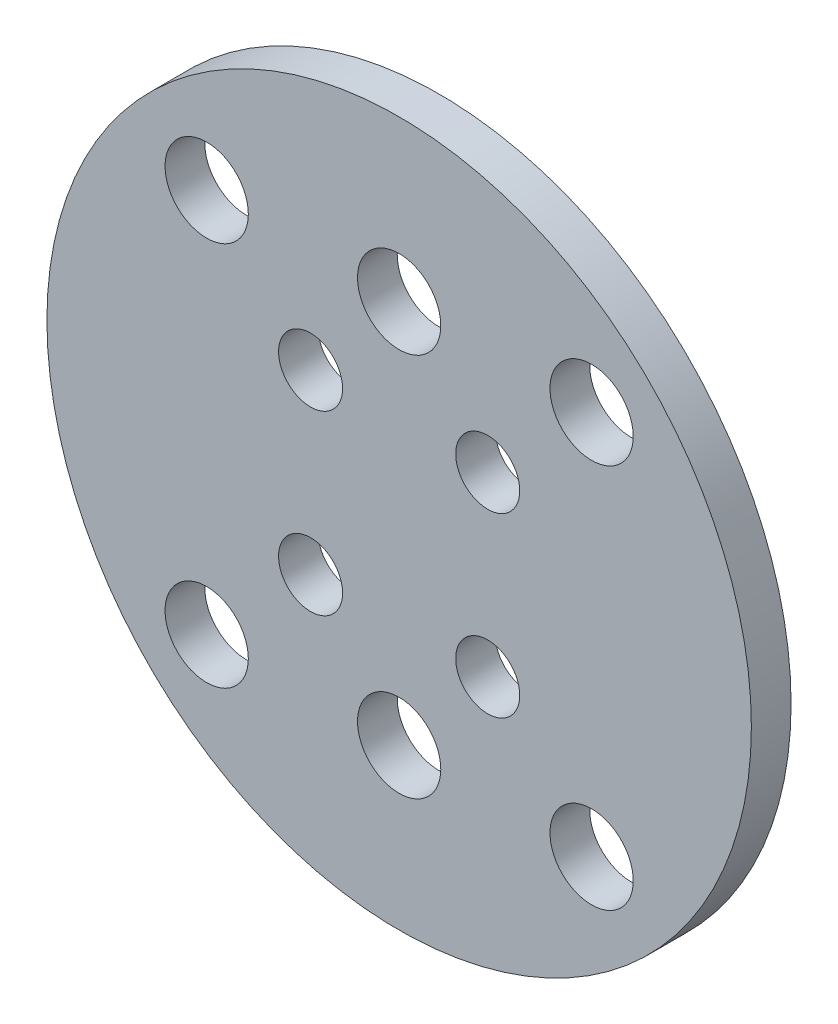
ISO-10303-21;
HEADER;
FILE_DESCRIPTION(('STEP AP214'),'2;1');
FILE_NAME('part.step','',(''),(''),'','','');
FILE_SCHEMA(('AUTOMOTIVE_DESIGN { 1 0 10303 214 1 1 1 1 }'));
ENDSEC;
DATA;
#1=APPLICATION_CONTEXT('core data for automotive mechanical design processes');
#2=APPLICATION_PROTOCOL_DEFINITION('international standard','automotive_design',2000,#1);
#3=PRODUCT_CONTEXT('',#1,'mechanical');
#4=PRODUCT('Part','Part','',(#3));
#5=PRODUCT_RELATED_PRODUCT_CATEGORY('part','',(#4));
#6=PRODUCT_DEFINITION_FORMATION('','',#4);
#7=PRODUCT_DEFINITION_CONTEXT('part definition',#1,'design');
#8=PRODUCT_DEFINITION('design','',#6,#7);
#9=PRODUCT_DEFINITION_SHAPE('','',#8);
#10=(LENGTH_UNIT() NAMED_UNIT(*) SI_UNIT(.MILLI.,.METRE.));
#11=(NAMED_UNIT(*) PLANE_ANGLE_UNIT() SI_UNIT($,.RADIAN.));
#12=(NAMED_UNIT(*) SI_UNIT($,.STERADIAN.) SOLID_ANGLE_UNIT());
#13=UNCERTAINTY_MEASURE_WITH_UNIT(LENGTH_MEASURE(1.E-05),#10,'distance_accuracy_value','');
#14=(GEOMETRIC_REPRESENTATION_CONTEXT(3) GLOBAL_UNCERTAINTY_ASSIGNED_CONTEXT((#13)) GLOBAL_UNIT_ASSIGNED_CONTEXT((#10,
#11,#12)) REPRESENTATION_CONTEXT('',''));
#15=CARTESIAN_POINT('',(0.,0.,0.));
#16=DIRECTION('',(0.,0.,1.));
#17=DIRECTION('',(1.,0.,0.));
#18=AXIS2_PLACEMENT_3D('',#15,#16,#17);
#19=CARTESIAN_POINT('',(0.,0.,3.1));
#20=DIRECTION('',(0.,0.,1.));
#21=DIRECTION('',(1.,0.,0.));
#22=AXIS2_PLACEMENT_3D('',#19,#20,#21);
#23=PLANE('',#22);
#24=CARTESIAN_POINT('',(15.0260191002142,15.0260191002141,3.1));
#25=DIRECTION('',(0.,0.,1.));
#26=DIRECTION('',(1.,0.,0.));
#27=AXIS2_PLACEMENT_3D('',#24,#25,#26);
#28=CIRCLE('',#27,3.25);
#29=CARTESIAN_POINT('',(18.2760191002142,15.0260191002141,3.1));
#30=VERTEX_POINT('',#29);
#31=EDGE_CURVE('E89',#30,#30,#28,.T.);
#32=ORIENTED_EDGE('',*,*,#31,.F.);
#33=EDGE_LOOP('',(#32));
#34=FACE_BOUND('',#33,.T.);
#35=CARTESIAN_POINT('',(-15.0260191002141,-15.0260191002141,3.1));
#36=DIRECTION('',(0.,0.,1.));
#37=DIRECTION('',(1.,0.,0.));
#38=AXIS2_PLACEMENT_3D('',#35,#36,#37);
#39=CIRCLE('',#38,3.25);
#40=CARTESIAN_POINT('',(-11.7760191002141,-15.0260191002141,3.1));
#41=VERTEX_POINT('',#40);
#42=EDGE_CURVE('E77',#41,#41,#39,.T.);
#43=ORIENTED_EDGE('',*,*,#42,.F.);
#44=EDGE_LOOP('',(#43));
#45=FACE_BOUND('',#44,.T.);
#46=CARTESIAN_POINT('',(15.0260191002141,-15.0260191002141,3.1));
#47=DIRECTION('',(0.,0.,1.));
#48=DIRECTION('',(1.,0.,0.));
#49=AXIS2_PLACEMENT_3D('',#46,#47,#48);
#50=CIRCLE('',#49,3.25);
#51=CARTESIAN_POINT('',(18.2760191002141,-15.0260191002141,3.1));
#52=VERTEX_POINT('',#51);
#53=EDGE_CURVE('E65',#52,#52,#50,.T.);
#54=ORIENTED_EDGE('',*,*,#53,.F.);
#55=EDGE_LOOP('',(#54));
#56=FACE_BOUND('',#55,.T.);
#57=CARTESIAN_POINT('',(6.91479721322346,-6.91479721322304,3.1));
#58=DIRECTION('',(0.,0.,1.));
#59=DIRECTION('',(1.,0.,0.));
#60=AXIS2_PLACEMENT_3D('',#57,#58,#59);
#61=CIRCLE('',#60,2.5);
#62=CARTESIAN_POINT('',(9.41479721322346,-6.91479721322304,3.1));
#63=VERTEX_POINT('',#62);
#64=EDGE_CURVE('E53',#63,#63,#61,.T.);
#65=ORIENTED_EDGE('',*,*,#64,.F.);
#66=EDGE_LOOP('',(#65));
#67=FACE_BOUND('',#66,.T.);
#68=CARTESIAN_POINT('',(-6.91479721322346,6.91479721322304,3.1));
#69=DIRECTION('',(0.,0.,1.));
#70=DIRECTION('',(1.,0.,0.));
#71=AXIS2_PLACEMENT_3D('',#68,#69,#70);
#72=CIRCLE('',#71,2.5);
#73=CARTESIAN_POINT('',(-4.41479721322345,6.91479721322304,3.1));
#74=VERTEX_POINT('',#73);
#75=EDGE_CURVE('E42',#74,#74,#72,.T.);
#76=ORIENTED_EDGE('',*,*,#75,.F.);
#77=EDGE_LOOP('',(#76));
#78=FACE_BOUND('',#77,.T.);
#79=CARTESIAN_POINT('',(0.,0.,3.1));
#80=DIRECTION('',(0.,0.,1.));
#81=DIRECTION('',(1.,0.,0.));
#82=AXIS2_PLACEMENT_3D('',#79,#80,#81);
#83=CIRCLE('',#82,27.5);
#84=CARTESIAN_POINT('',(27.5,0.,3.1));
#85=VERTEX_POINT('',#84);
#86=EDGE_CURVE('E10',#85,#85,#83,.T.);
#87=ORIENTED_EDGE('',*,*,#86,.T.);
#88=EDGE_LOOP('',(#87));
#89=FACE_BOUND('',#88,.T.);
#90=CARTESIAN_POINT('',(6.91479721322304,6.91479721322346,3.1));
#91=DIRECTION('',(0.,0.,1.));
#92=DIRECTION('',(1.,0.,0.));
#93=AXIS2_PLACEMENT_3D('',#90,#91,#92);
#94=CIRCLE('',#93,2.5);
#95=CARTESIAN_POINT('',(9.41479721322304,6.91479721322346,3.1));
#96=VERTEX_POINT('',#95);
#97=EDGE_CURVE('E47',#96,#96,#94,.T.);
#98=ORIENTED_EDGE('',*,*,#97,.F.);
#99=EDGE_LOOP('',(#98));
#100=FACE_BOUND('',#99,.T.);
#101=CARTESIAN_POINT('',(-6.91479721322304,-6.91479721322346,3.1));
#102=DIRECTION('',(0.,0.,1.));
#103=DIRECTION('',(1.,0.,0.));
#104=AXIS2_PLACEMENT_3D('',#101,#102,#103);
#105=CIRCLE('',#104,2.5);
#106=CARTESIAN_POINT('',(-4.41479721322304,-6.91479721322346,3.1));
#107=VERTEX_POINT('',#106);
#108=EDGE_CURVE('E59',#107,#107,#105,.T.);
#109=ORIENTED_EDGE('',*,*,#108,.F.);
#110=EDGE_LOOP('',(#109));
#111=FACE_BOUND('',#110,.T.);
#112=CARTESIAN_POINT('',(0.,-15.,3.1));
#113=DIRECTION('',(0.,0.,1.));
#114=DIRECTION('',(1.,0.,0.));
#115=AXIS2_PLACEMENT_3D('',#112,#113,#114);
#116=CIRCLE('',#115,3.25);
#117=CARTESIAN_POINT('',(3.25,-15.,3.1));
#118=VERTEX_POINT('',#117);
#119=EDGE_CURVE('E71',#118,#118,#116,.T.);
#120=ORIENTED_EDGE('',*,*,#119,.F.);
#121=EDGE_LOOP('',(#120));
#122=FACE_BOUND('',#121,.T.);
#123=CARTESIAN_POINT('',(-15.0260191002141,15.0260191002142,3.1));
#124=DIRECTION('',(0.,0.,1.));
#125=DIRECTION('',(1.,0.,0.));
#126=AXIS2_PLACEMENT_3D('',#123,#124,#125);
#127=CIRCLE('',#126,3.25);
#128=CARTESIAN_POINT('',(-11.7760191002141,15.0260191002142,3.1));
#129=VERTEX_POINT('',#128);
#130=EDGE_CURVE('E83',#129,#129,#127,.T.);
#131=ORIENTED_EDGE('',*,*,#130,.F.);
#132=EDGE_LOOP('',(#131));
#133=FACE_BOUND('',#132,.T.);
#134=CARTESIAN_POINT('',(0.,15.,3.1));
#135=DIRECTION('',(0.,0.,1.));
#136=DIRECTION('',(-1.,0.,0.));
#137=AXIS2_PLACEMENT_3D('',#134,#135,#136);
#138=CIRCLE('',#137,3.25);
#139=CARTESIAN_POINT('',(-3.25,15.,3.1));
#140=VERTEX_POINT('',#139);
#141=EDGE_CURVE('E95',#140,#140,#138,.T.);
#142=ORIENTED_EDGE('',*,*,#141,.F.);
#143=EDGE_LOOP('',(#142));
#144=FACE_BOUND('',#143,.T.);
#145=ADVANCED_FACE('F31',(#34,#45,#56,#67,#78,#89,#100,#111,#122,#133,#144),#23,.T.);
#146=CARTESIAN_POINT('',(0.,0.,0.));
#147=DIRECTION('',(0.,0.,1.));
#148=DIRECTION('',(1.,0.,0.));
#149=AXIS2_PLACEMENT_3D('',#146,#147,#148);
#150=PLANE('',#149);
#151=CARTESIAN_POINT('',(15.0260191002142,15.0260191002141,0.));
#152=DIRECTION('',(0.,0.,1.));
#153=DIRECTION('',(1.,0.,0.));
#154=AXIS2_PLACEMENT_3D('',#151,#152,#153);
#155=CIRCLE('',#154,3.25);
#156=CARTESIAN_POINT('',(18.2760191002142,15.0260191002141,0.));
#157=VERTEX_POINT('',#156);
#158=EDGE_CURVE('E92',#157,#157,#155,.T.);
#159=ORIENTED_EDGE('',*,*,#158,.T.);
#160=EDGE_LOOP('',(#159));
#161=FACE_BOUND('',#160,.T.);
#162=CARTESIAN_POINT('',(-15.0260191002141,-15.0260191002141,0.));
#163=DIRECTION('',(0.,0.,1.));
#164=DIRECTION('',(1.,0.,0.));
#165=AXIS2_PLACEMENT_3D('',#162,#163,#164);
#166=CIRCLE('',#165,3.25);
#167=CARTESIAN_POINT('',(-11.7760191002141,-15.0260191002141,0.));
#168=VERTEX_POINT('',#167);
#169=EDGE_CURVE('E80',#168,#168,#166,.T.);
#170=ORIENTED_EDGE('',*,*,#169,.T.);
#171=EDGE_LOOP('',(#170));
#172=FACE_BOUND('',#171,.T.);
#173=CARTESIAN_POINT('',(15.0260191002141,-15.0260191002141,0.));
#174=DIRECTION('',(0.,0.,1.));
#175=DIRECTION('',(1.,0.,0.));
#176=AXIS2_PLACEMENT_3D('',#173,#174,#175);
#177=CIRCLE('',#176,3.25);
#178=CARTESIAN_POINT('',(18.2760191002141,-15.0260191002141,0.));
#179=VERTEX_POINT('',#178);
#180=EDGE_CURVE('E68',#179,#179,#177,.T.);
#181=ORIENTED_EDGE('',*,*,#180,.T.);
#182=EDGE_LOOP('',(#181));
#183=FACE_BOUND('',#182,.T.);
#184=CARTESIAN_POINT('',(6.91479721322346,-6.91479721322304,0.));
#185=DIRECTION('',(0.,0.,1.));
#186=DIRECTION('',(1.,0.,0.));
#187=AXIS2_PLACEMENT_3D('',#184,#185,#186);
#188=CIRCLE('',#187,2.5);
#189=CARTESIAN_POINT('',(9.41479721322346,-6.91479721322304,0.));
#190=VERTEX_POINT('',#189);
#191=EDGE_CURVE('E56',#190,#190,#188,.T.);
#192=ORIENTED_EDGE('',*,*,#191,.T.);
#193=EDGE_LOOP('',(#192));
#194=FACE_BOUND('',#193,.T.);
#195=CARTESIAN_POINT('',(-6.91479721322346,6.91479721322304,0.));
#196=DIRECTION('',(0.,0.,1.));
#197=DIRECTION('',(1.,0.,0.));
#198=AXIS2_PLACEMENT_3D('',#195,#196,#197);
#199=CIRCLE('',#198,2.5);
#200=CARTESIAN_POINT('',(-4.41479721322345,6.91479721322304,0.));
#201=VERTEX_POINT('',#200);
#202=EDGE_CURVE('E44',#201,#201,#199,.T.);
#203=ORIENTED_EDGE('',*,*,#202,.T.);
#204=EDGE_LOOP('',(#203));
#205=FACE_BOUND('',#204,.T.);
#206=CARTESIAN_POINT('',(0.,0.,0.));
#207=DIRECTION('',(0.,0.,1.));
#208=DIRECTION('',(1.,0.,0.));
#209=AXIS2_PLACEMENT_3D('',#206,#207,#208);
#210=CIRCLE('',#209,27.5);
#211=CARTESIAN_POINT('',(27.5,0.,0.));
#212=VERTEX_POINT('',#211);
#213=EDGE_CURVE('E35',#212,#212,#210,.T.);
#214=ORIENTED_EDGE('',*,*,#213,.F.);
#215=EDGE_LOOP('',(#214));
#216=FACE_BOUND('',#215,.T.);
#217=CARTESIAN_POINT('',(6.91479721322304,6.91479721322346,0.));
#218=DIRECTION('',(0.,0.,1.));
#219=DIRECTION('',(1.,0.,0.));
#220=AXIS2_PLACEMENT_3D('',#217,#218,#219);
#221=CIRCLE('',#220,2.5);
#222=CARTESIAN_POINT('',(9.41479721322304,6.91479721322346,0.));
#223=VERTEX_POINT('',#222);
#224=EDGE_CURVE('E50',#223,#223,#221,.T.);
#225=ORIENTED_EDGE('',*,*,#224,.T.);
#226=EDGE_LOOP('',(#225));
#227=FACE_BOUND('',#226,.T.);
#228=CARTESIAN_POINT('',(-6.91479721322304,-6.91479721322346,0.));
#229=DIRECTION('',(0.,0.,1.));
#230=DIRECTION('',(1.,0.,0.));
#231=AXIS2_PLACEMENT_3D('',#228,#229,#230);
#232=CIRCLE('',#231,2.5);
#233=CARTESIAN_POINT('',(-4.41479721322304,-6.91479721322346,0.));
#234=VERTEX_POINT('',#233);
#235=EDGE_CURVE('E62',#234,#234,#232,.T.);
#236=ORIENTED_EDGE('',*,*,#235,.T.);
#237=EDGE_LOOP('',(#236));
#238=FACE_BOUND('',#237,.T.);
#239=CARTESIAN_POINT('',(0.,-15.,0.));
#240=DIRECTION('',(0.,0.,1.));
#241=DIRECTION('',(1.,0.,0.));
#242=AXIS2_PLACEMENT_3D('',#239,#240,#241);
#243=CIRCLE('',#242,3.25);
#244=CARTESIAN_POINT('',(3.25,-15.,0.));
#245=VERTEX_POINT('',#244);
#246=EDGE_CURVE('E74',#245,#245,#243,.T.);
#247=ORIENTED_EDGE('',*,*,#246,.T.);
#248=EDGE_LOOP('',(#247));
#249=FACE_BOUND('',#248,.T.);
#250=CARTESIAN_POINT('',(-15.0260191002141,15.0260191002142,0.));
#251=DIRECTION('',(0.,0.,1.));
#252=DIRECTION('',(1.,0.,0.));
#253=AXIS2_PLACEMENT_3D('',#250,#251,#252);
#254=CIRCLE('',#253,3.25);
#255=CARTESIAN_POINT('',(-11.7760191002141,15.0260191002142,0.));
#256=VERTEX_POINT('',#255);
#257=EDGE_CURVE('E86',#256,#256,#254,.T.);
#258=ORIENTED_EDGE('',*,*,#257,.T.);
#259=EDGE_LOOP('',(#258));
#260=FACE_BOUND('',#259,.T.);
#261=CARTESIAN_POINT('',(0.,15.,0.));
#262=DIRECTION('',(0.,0.,1.));
#263=DIRECTION('',(-1.,0.,0.));
#264=AXIS2_PLACEMENT_3D('',#261,#262,#263);
#265=CIRCLE('',#264,3.25);
#266=CARTESIAN_POINT('',(-3.25,15.,0.));
#267=VERTEX_POINT('',#266);
#268=EDGE_CURVE('E98',#267,#267,#265,.T.);
#269=ORIENTED_EDGE('',*,*,#268,.T.);
#270=EDGE_LOOP('',(#269));
#271=FACE_BOUND('',#270,.T.);
#272=ADVANCED_FACE('F108',(#161,#172,#183,#194,#205,#216,#227,#238,#249,#260,#271),#150,.F.);
#273=CARTESIAN_POINT('',(0.,0.,3.1));
#274=DIRECTION('',(0.,0.,-1.));
#275=DIRECTION('',(-1.,0.,0.));
#276=AXIS2_PLACEMENT_3D('',#273,#274,#275);
#277=CYLINDRICAL_SURFACE('',#276,27.5);
#278=ORIENTED_EDGE('',*,*,#86,.F.);
#279=EDGE_LOOP('',(#278));
#280=FACE_BOUND('',#279,.T.);
#281=ORIENTED_EDGE('',*,*,#213,.T.);
#282=EDGE_LOOP('',(#281));
#283=FACE_BOUND('',#282,.T.);
#284=ADVANCED_FACE('F33',(#280,#283),#277,.T.);
#285=CARTESIAN_POINT('',(-6.91479721322346,6.91479721322304,3.1));
#286=DIRECTION('',(0.,0.,-1.));
#287=DIRECTION('',(-1.,0.,0.));
#288=AXIS2_PLACEMENT_3D('',#285,#286,#287);
#289=CYLINDRICAL_SURFACE('',#288,2.5);
#290=ORIENTED_EDGE('',*,*,#75,.T.);
#291=EDGE_LOOP('',(#290));
#292=FACE_BOUND('',#291,.T.);
#293=ORIENTED_EDGE('',*,*,#202,.F.);
#294=EDGE_LOOP('',(#293));
#295=FACE_BOUND('',#294,.T.);
#296=ADVANCED_FACE('F118',(#292,#295),#289,.F.);
#297=CARTESIAN_POINT('',(6.91479721322304,6.91479721322346,3.1));
#298=DIRECTION('',(0.,0.,-1.));
#299=DIRECTION('',(-1.,0.,0.));
#300=AXIS2_PLACEMENT_3D('',#297,#298,#299);
#301=CYLINDRICAL_SURFACE('',#300,2.5);
#302=ORIENTED_EDGE('',*,*,#97,.T.);
#303=EDGE_LOOP('',(#302));
#304=FACE_BOUND('',#303,.T.);
#305=ORIENTED_EDGE('',*,*,#224,.F.);
#306=EDGE_LOOP('',(#305));
#307=FACE_BOUND('',#306,.T.);
#308=ADVANCED_FACE('F121',(#304,#307),#301,.F.);
#309=CARTESIAN_POINT('',(6.91479721322346,-6.91479721322304,3.1));
#310=DIRECTION('',(0.,0.,-1.));
#311=DIRECTION('',(-1.,0.,0.));
#312=AXIS2_PLACEMENT_3D('',#309,#310,#311);
#313=CYLINDRICAL_SURFACE('',#312,2.5);
#314=ORIENTED_EDGE('',*,*,#64,.T.);
#315=EDGE_LOOP('',(#314));
#316=FACE_BOUND('',#315,.T.);
#317=ORIENTED_EDGE('',*,*,#191,.F.);
#318=EDGE_LOOP('',(#317));
#319=FACE_BOUND('',#318,.T.);
#320=ADVANCED_FACE('F125',(#316,#319),#313,.F.);
#321=CARTESIAN_POINT('',(-6.91479721322304,-6.91479721322346,3.1));
#322=DIRECTION('',(0.,0.,-1.));
#323=DIRECTION('',(-1.,0.,0.));
#324=AXIS2_PLACEMENT_3D('',#321,#322,#323);
#325=CYLINDRICAL_SURFACE('',#324,2.5);
#326=ORIENTED_EDGE('',*,*,#108,.T.);
#327=EDGE_LOOP('',(#326));
#328=FACE_BOUND('',#327,.T.);
#329=ORIENTED_EDGE('',*,*,#235,.F.);
#330=EDGE_LOOP('',(#329));
#331=FACE_BOUND('',#330,.T.);
#332=ADVANCED_FACE('F129',(#328,#331),#325,.F.);
#333=CARTESIAN_POINT('',(15.0260191002141,-15.0260191002141,3.1));
#334=DIRECTION('',(0.,0.,-1.));
#335=DIRECTION('',(-1.,0.,0.));
#336=AXIS2_PLACEMENT_3D('',#333,#334,#335);
#337=CYLINDRICAL_SURFACE('',#336,3.25);
#338=ORIENTED_EDGE('',*,*,#53,.T.);
#339=EDGE_LOOP('',(#338));
#340=FACE_BOUND('',#339,.T.);
#341=ORIENTED_EDGE('',*,*,#180,.F.);
#342=EDGE_LOOP('',(#341));
#343=FACE_BOUND('',#342,.T.);
#344=ADVANCED_FACE('F133',(#340,#343),#337,.F.);
#345=CARTESIAN_POINT('',(0.,-15.,3.1));
#346=DIRECTION('',(0.,0.,-1.));
#347=DIRECTION('',(-1.,0.,0.));
#348=AXIS2_PLACEMENT_3D('',#345,#346,#347);
#349=CYLINDRICAL_SURFACE('',#348,3.25);
#350=ORIENTED_EDGE('',*,*,#119,.T.);
#351=EDGE_LOOP('',(#350));
#352=FACE_BOUND('',#351,.T.);
#353=ORIENTED_EDGE('',*,*,#246,.F.);
#354=EDGE_LOOP('',(#353));
#355=FACE_BOUND('',#354,.T.);
#356=ADVANCED_FACE('F137',(#352,#355),#349,.F.);
#357=CARTESIAN_POINT('',(-15.0260191002141,-15.0260191002141,3.1));
#358=DIRECTION('',(0.,0.,-1.));
#359=DIRECTION('',(-1.,0.,0.));
#360=AXIS2_PLACEMENT_3D('',#357,#358,#359);
#361=CYLINDRICAL_SURFACE('',#360,3.25);
#362=ORIENTED_EDGE('',*,*,#42,.T.);
#363=EDGE_LOOP('',(#362));
#364=FACE_BOUND('',#363,.T.);
#365=ORIENTED_EDGE('',*,*,#169,.F.);
#366=EDGE_LOOP('',(#365));
#367=FACE_BOUND('',#366,.T.);
#368=ADVANCED_FACE('F141',(#364,#367),#361,.F.);
#369=CARTESIAN_POINT('',(-15.0260191002141,15.0260191002142,3.1));
#370=DIRECTION('',(0.,0.,-1.));
#371=DIRECTION('',(-1.,0.,0.));
#372=AXIS2_PLACEMENT_3D('',#369,#370,#371);
#373=CYLINDRICAL_SURFACE('',#372,3.25);
#374=ORIENTED_EDGE('',*,*,#130,.T.);
#375=EDGE_LOOP('',(#374));
#376=FACE_BOUND('',#375,.T.);
#377=ORIENTED_EDGE('',*,*,#257,.F.);
#378=EDGE_LOOP('',(#377));
#379=FACE_BOUND('',#378,.T.);
#380=ADVANCED_FACE('F145',(#376,#379),#373,.F.);
#381=CARTESIAN_POINT('',(15.0260191002142,15.0260191002141,3.1));
#382=DIRECTION('',(0.,0.,-1.));
#383=DIRECTION('',(-1.,0.,0.));
#384=AXIS2_PLACEMENT_3D('',#381,#382,#383);
#385=CYLINDRICAL_SURFACE('',#384,3.25);
#386=ORIENTED_EDGE('',*,*,#31,.T.);
#387=EDGE_LOOP('',(#386));
#388=FACE_BOUND('',#387,.T.);
#389=ORIENTED_EDGE('',*,*,#158,.F.);
#390=EDGE_LOOP('',(#389));
#391=FACE_BOUND('',#390,.T.);
#392=ADVANCED_FACE('F149',(#388,#391),#385,.F.);
#393=CARTESIAN_POINT('',(0.,15.,3.1));
#394=DIRECTION('',(0.,0.,-1.));
#395=DIRECTION('',(-1.,0.,0.));
#396=AXIS2_PLACEMENT_3D('',#393,#394,#395);
#397=CYLINDRICAL_SURFACE('',#396,3.25);
#398=ORIENTED_EDGE('',*,*,#141,.T.);
#399=EDGE_LOOP('',(#398));
#400=FACE_BOUND('',#399,.T.);
#401=ORIENTED_EDGE('',*,*,#268,.F.);
#402=EDGE_LOOP('',(#401));
#403=FACE_BOUND('',#402,.T.);
#404=ADVANCED_FACE('F104',(#400,#403),#397,.F.);
#405=CLOSED_SHELL('',(#145,#272,#284,#296,#308,#320,#332,#344,#356,#368,#380,#392,#404));
#406=MANIFOLD_SOLID_BREP('B2',#405);
#407=ADVANCED_BREP_SHAPE_REPRESENTATION('',(#18,#406),#14);
#408=SHAPE_DEFINITION_REPRESENTATION(#9,#407);
ENDSEC;
END-ISO-10303-21;
